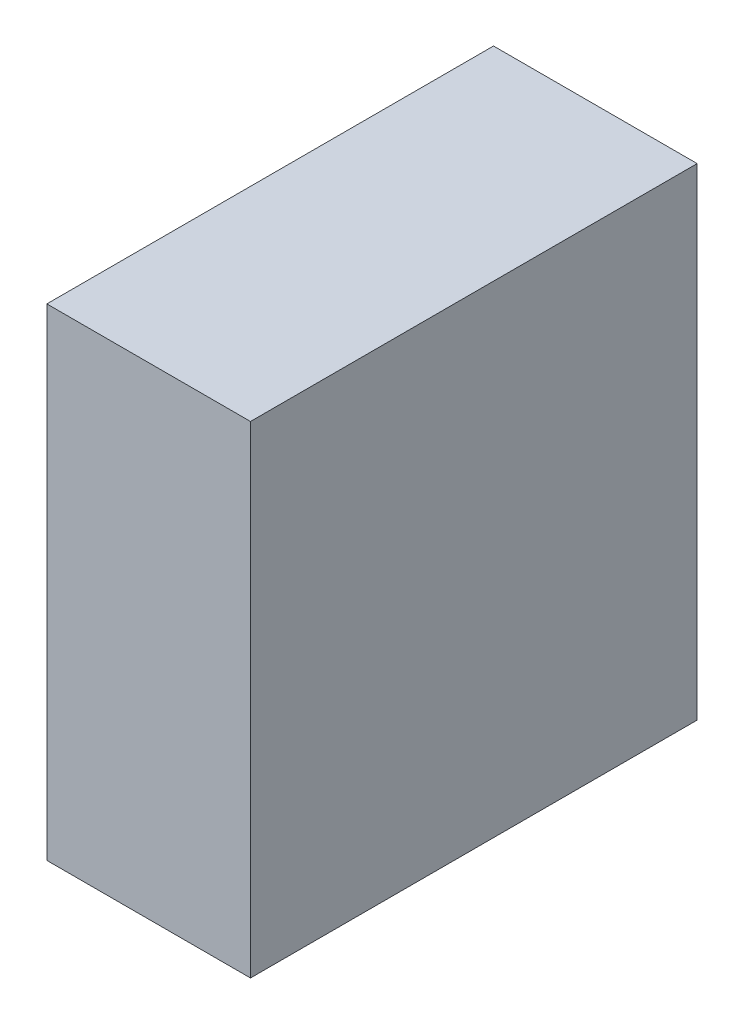
ISO-10303-21;
HEADER;
FILE_DESCRIPTION(('STEP AP214'),'2;1');
FILE_NAME('part.step','',(''),(''),'','','');
FILE_SCHEMA(('AUTOMOTIVE_DESIGN { 1 0 10303 214 1 1 1 1 }'));
ENDSEC;
DATA;
#1=APPLICATION_CONTEXT('core data for automotive mechanical design processes');
#2=APPLICATION_PROTOCOL_DEFINITION('international standard','automotive_design',2000,#1);
#3=PRODUCT_CONTEXT('',#1,'mechanical');
#4=PRODUCT('Part','Part','',(#3));
#5=PRODUCT_RELATED_PRODUCT_CATEGORY('part','',(#4));
#6=PRODUCT_DEFINITION_FORMATION('','',#4);
#7=PRODUCT_DEFINITION_CONTEXT('part definition',#1,'design');
#8=PRODUCT_DEFINITION('design','',#6,#7);
#9=PRODUCT_DEFINITION_SHAPE('','',#8);
#10=(LENGTH_UNIT() NAMED_UNIT(*) SI_UNIT(.MILLI.,.METRE.));
#11=(NAMED_UNIT(*) PLANE_ANGLE_UNIT() SI_UNIT($,.RADIAN.));
#12=(NAMED_UNIT(*) SI_UNIT($,.STERADIAN.) SOLID_ANGLE_UNIT());
#13=UNCERTAINTY_MEASURE_WITH_UNIT(LENGTH_MEASURE(1.E-05),#10,'distance_accuracy_value','');
#14=(GEOMETRIC_REPRESENTATION_CONTEXT(3) GLOBAL_UNCERTAINTY_ASSIGNED_CONTEXT((#13)) GLOBAL_UNIT_ASSIGNED_CONTEXT((#10,
#11,#12)) REPRESENTATION_CONTEXT('',''));
#15=CARTESIAN_POINT('',(0.,0.,0.));
#16=DIRECTION('',(0.,0.,1.));
#17=DIRECTION('',(1.,0.,0.));
#18=AXIS2_PLACEMENT_3D('',#15,#16,#17);
#19=CARTESIAN_POINT('',(0.,180.34,0.));
#20=DIRECTION('',(-1.,0.,0.));
#21=DIRECTION('',(0.,0.,1.));
#22=AXIS2_PLACEMENT_3D('',#19,#20,#21);
#23=PLANE('',#22);
#24=DIRECTION('',(0.,0.,-1.));
#25=VECTOR('',#24,1.);
#26=CARTESIAN_POINT('',(0.,0.,0.));
#27=LINE('',#26,#25);
#28=CARTESIAN_POINT('',(0.,0.,167.132));
#29=VERTEX_POINT('',#28);
#30=CARTESIAN_POINT('',(0.,0.,0.));
#31=VERTEX_POINT('',#30);
#32=EDGE_CURVE('E20',#29,#31,#27,.T.);
#33=ORIENTED_EDGE('',*,*,#32,.F.);
#34=DIRECTION('',(0.,1.,0.));
#35=VECTOR('',#34,1.);
#36=CARTESIAN_POINT('',(0.,0.,167.132));
#37=LINE('',#36,#35);
#38=CARTESIAN_POINT('',(0.,180.34,167.132));
#39=VERTEX_POINT('',#38);
#40=EDGE_CURVE('E81',#39,#29,#37,.F.);
#41=ORIENTED_EDGE('',*,*,#40,.F.);
#42=DIRECTION('',(0.,0.,1.));
#43=VECTOR('',#42,1.);
#44=CARTESIAN_POINT('',(0.,180.34,0.));
#45=LINE('',#44,#43);
#46=CARTESIAN_POINT('',(0.,180.34,0.));
#47=VERTEX_POINT('',#46);
#48=EDGE_CURVE('E68',#47,#39,#45,.T.);
#49=ORIENTED_EDGE('',*,*,#48,.F.);
#50=DIRECTION('',(0.,1.,0.));
#51=VECTOR('',#50,1.);
#52=CARTESIAN_POINT('',(0.,0.,0.));
#53=LINE('',#52,#51);
#54=EDGE_CURVE('E55',#47,#31,#53,.F.);
#55=ORIENTED_EDGE('',*,*,#54,.T.);
#56=EDGE_LOOP('',(#33,#41,#49,#55));
#57=FACE_BOUND('',#56,.T.);
#58=ADVANCED_FACE('F17',(#57),#23,.T.);
#59=CARTESIAN_POINT('',(0.,0.,0.));
#60=DIRECTION('',(0.,-1.,0.));
#61=DIRECTION('',(0.,0.,-1.));
#62=AXIS2_PLACEMENT_3D('',#59,#60,#61);
#63=PLANE('',#62);
#64=DIRECTION('',(0.,0.,-1.));
#65=VECTOR('',#64,1.);
#66=CARTESIAN_POINT('',(76.2,0.,0.));
#67=LINE('',#66,#65);
#68=CARTESIAN_POINT('',(76.2,0.,167.132));
#69=VERTEX_POINT('',#68);
#70=CARTESIAN_POINT('',(76.2,0.,0.));
#71=VERTEX_POINT('',#70);
#72=EDGE_CURVE('E83',#69,#71,#67,.T.);
#73=ORIENTED_EDGE('',*,*,#72,.F.);
#74=DIRECTION('',(1.,0.,0.));
#75=VECTOR('',#74,1.);
#76=CARTESIAN_POINT('',(0.,0.,167.132));
#77=LINE('',#76,#75);
#78=EDGE_CURVE('E64',#29,#69,#77,.T.);
#79=ORIENTED_EDGE('',*,*,#78,.F.);
#80=ORIENTED_EDGE('',*,*,#32,.T.);
#81=DIRECTION('',(1.,0.,0.));
#82=VECTOR('',#81,1.);
#83=CARTESIAN_POINT('',(0.,0.,0.));
#84=LINE('',#83,#82);
#85=EDGE_CURVE('E61',#31,#71,#84,.T.);
#86=ORIENTED_EDGE('',*,*,#85,.T.);
#87=EDGE_LOOP('',(#73,#79,#80,#86));
#88=FACE_BOUND('',#87,.T.);
#89=ADVANCED_FACE('F60',(#88),#63,.T.);
#90=CARTESIAN_POINT('',(0.,0.,0.));
#91=DIRECTION('',(0.,0.,1.));
#92=DIRECTION('',(1.,0.,0.));
#93=AXIS2_PLACEMENT_3D('',#90,#91,#92);
#94=PLANE('',#93);
#95=DIRECTION('',(1.,0.,0.));
#96=VECTOR('',#95,1.);
#97=CARTESIAN_POINT('',(76.2,180.34,0.));
#98=LINE('',#97,#96);
#99=CARTESIAN_POINT('',(76.2,180.34,0.));
#100=VERTEX_POINT('',#99);
#101=EDGE_CURVE('E70',#100,#47,#98,.F.);
#102=ORIENTED_EDGE('',*,*,#101,.F.);
#103=DIRECTION('',(0.,1.,0.));
#104=VECTOR('',#103,1.);
#105=CARTESIAN_POINT('',(76.2,0.,0.));
#106=LINE('',#105,#104);
#107=EDGE_CURVE('E74',#71,#100,#106,.T.);
#108=ORIENTED_EDGE('',*,*,#107,.F.);
#109=ORIENTED_EDGE('',*,*,#85,.F.);
#110=ORIENTED_EDGE('',*,*,#54,.F.);
#111=EDGE_LOOP('',(#102,#108,#109,#110));
#112=FACE_BOUND('',#111,.T.);
#113=ADVANCED_FACE('F72',(#112),#94,.F.);
#114=CARTESIAN_POINT('',(76.2,180.34,0.));
#115=DIRECTION('',(0.,1.,0.));
#116=DIRECTION('',(0.,0.,1.));
#117=AXIS2_PLACEMENT_3D('',#114,#115,#116);
#118=PLANE('',#117);
#119=ORIENTED_EDGE('',*,*,#48,.T.);
#120=DIRECTION('',(1.,0.,0.));
#121=VECTOR('',#120,1.);
#122=CARTESIAN_POINT('',(0.,180.34,167.132));
#123=LINE('',#122,#121);
#124=CARTESIAN_POINT('',(76.2,180.34,167.132));
#125=VERTEX_POINT('',#124);
#126=EDGE_CURVE('E35',#125,#39,#123,.F.);
#127=ORIENTED_EDGE('',*,*,#126,.F.);
#128=DIRECTION('',(0.,0.,-1.));
#129=VECTOR('',#128,1.);
#130=CARTESIAN_POINT('',(76.2,180.34,0.));
#131=LINE('',#130,#129);
#132=EDGE_CURVE('E26',#100,#125,#131,.F.);
#133=ORIENTED_EDGE('',*,*,#132,.F.);
#134=ORIENTED_EDGE('',*,*,#101,.T.);
#135=EDGE_LOOP('',(#119,#127,#133,#134));
#136=FACE_BOUND('',#135,.T.);
#137=ADVANCED_FACE('F89',(#136),#118,.T.);
#138=CARTESIAN_POINT('',(0.,0.,167.132));
#139=DIRECTION('',(0.,0.,1.));
#140=DIRECTION('',(1.,0.,0.));
#141=AXIS2_PLACEMENT_3D('',#138,#139,#140);
#142=PLANE('',#141);
#143=ORIENTED_EDGE('',*,*,#126,.T.);
#144=ORIENTED_EDGE('',*,*,#40,.T.);
#145=ORIENTED_EDGE('',*,*,#78,.T.);
#146=DIRECTION('',(0.,1.,0.));
#147=VECTOR('',#146,1.);
#148=CARTESIAN_POINT('',(76.2,0.,167.132));
#149=LINE('',#148,#147);
#150=EDGE_CURVE('E11',#125,#69,#149,.F.);
#151=ORIENTED_EDGE('',*,*,#150,.F.);
#152=EDGE_LOOP('',(#143,#144,#145,#151));
#153=FACE_BOUND('',#152,.T.);
#154=ADVANCED_FACE('F91',(#153),#142,.T.);
#155=CARTESIAN_POINT('',(76.2,0.,0.));
#156=DIRECTION('',(1.,0.,0.));
#157=DIRECTION('',(0.,0.,-1.));
#158=AXIS2_PLACEMENT_3D('',#155,#156,#157);
#159=PLANE('',#158);
#160=ORIENTED_EDGE('',*,*,#132,.T.);
#161=ORIENTED_EDGE('',*,*,#150,.T.);
#162=ORIENTED_EDGE('',*,*,#72,.T.);
#163=ORIENTED_EDGE('',*,*,#107,.T.);
#164=EDGE_LOOP('',(#160,#161,#162,#163));
#165=FACE_BOUND('',#164,.T.);
#166=ADVANCED_FACE('F88',(#165),#159,.T.);
#167=CLOSED_SHELL('',(#58,#89,#113,#137,#154,#166));
#168=MANIFOLD_SOLID_BREP('B1',#167);
#169=ADVANCED_BREP_SHAPE_REPRESENTATION('',(#18,#168),#14);
#170=SHAPE_DEFINITION_REPRESENTATION(#9,#169);
ENDSEC;
END-ISO-10303-21;
